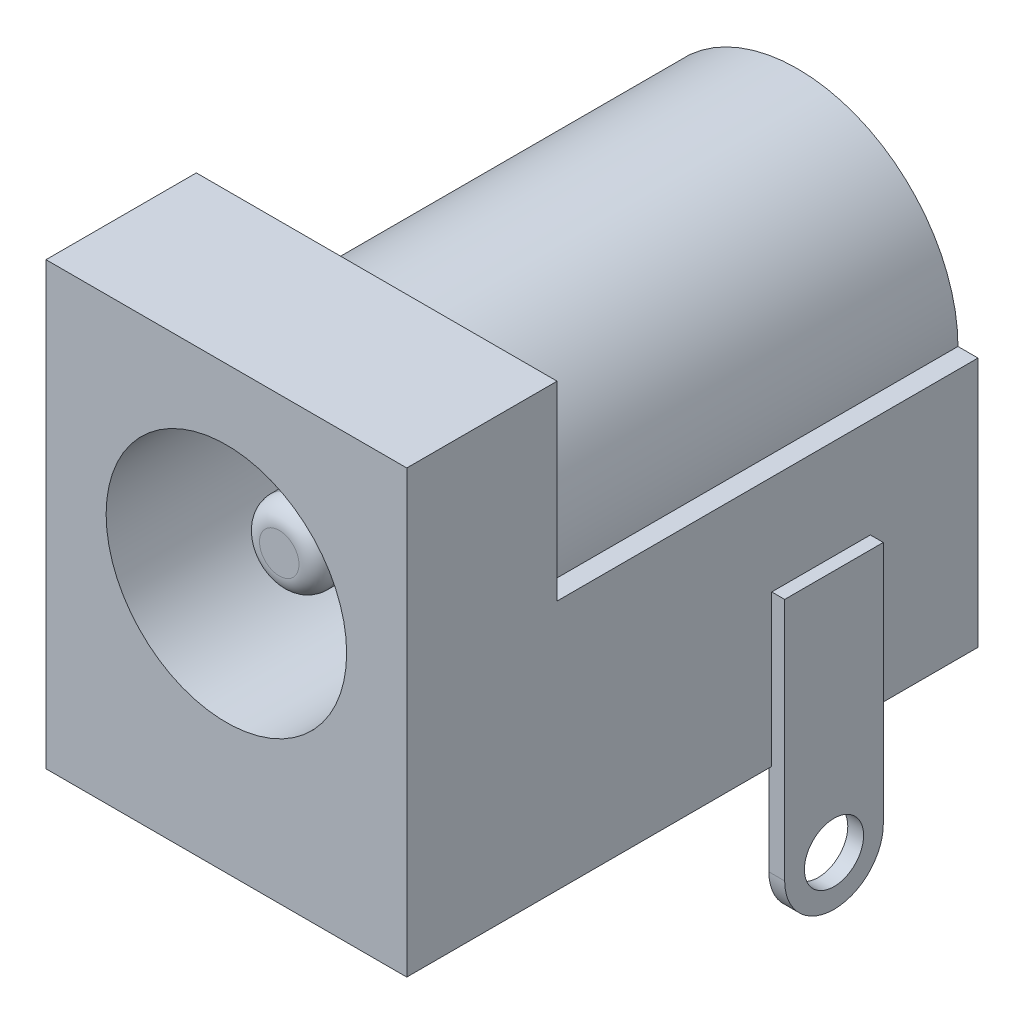
ISO-10303-21;
HEADER;
FILE_DESCRIPTION(('STEP AP214'),'2;1');
FILE_NAME('part.step','',(''),(''),'','','');
FILE_SCHEMA(('AUTOMOTIVE_DESIGN { 1 0 10303 214 1 1 1 1 }'));
ENDSEC;
DATA;
#1=APPLICATION_CONTEXT('core data for automotive mechanical design processes');
#2=APPLICATION_PROTOCOL_DEFINITION('international standard','automotive_design',2000,#1);
#3=PRODUCT_CONTEXT('',#1,'mechanical');
#4=PRODUCT('Part','Part','',(#3));
#5=PRODUCT_RELATED_PRODUCT_CATEGORY('part','',(#4));
#6=PRODUCT_DEFINITION_FORMATION('','',#4);
#7=PRODUCT_DEFINITION_CONTEXT('part definition',#1,'design');
#8=PRODUCT_DEFINITION('design','',#6,#7);
#9=PRODUCT_DEFINITION_SHAPE('','',#8);
#10=(LENGTH_UNIT() NAMED_UNIT(*) SI_UNIT(.MILLI.,.METRE.));
#11=(NAMED_UNIT(*) PLANE_ANGLE_UNIT() SI_UNIT($,.RADIAN.));
#12=(NAMED_UNIT(*) SI_UNIT($,.STERADIAN.) SOLID_ANGLE_UNIT());
#13=UNCERTAINTY_MEASURE_WITH_UNIT(LENGTH_MEASURE(1.E-05),#10,'distance_accuracy_value','');
#14=(GEOMETRIC_REPRESENTATION_CONTEXT(3) GLOBAL_UNCERTAINTY_ASSIGNED_CONTEXT((#13)) GLOBAL_UNIT_ASSIGNED_CONTEXT((#10,
#11,#12)) REPRESENTATION_CONTEXT('',''));
#15=CARTESIAN_POINT('',(0.,0.,0.));
#16=DIRECTION('',(0.,0.,1.));
#17=DIRECTION('',(1.,0.,0.));
#18=AXIS2_PLACEMENT_3D('',#15,#16,#17);
#19=CARTESIAN_POINT('',(-4.572,0.,-3.81));
#20=DIRECTION('',(0.,-1.,0.));
#21=DIRECTION('',(1.,0.,0.));
#22=AXIS2_PLACEMENT_3D('',#19,#20,#21);
#23=PLANE('',#22);
#24=DIRECTION('',(-1.,0.,0.));
#25=VECTOR('',#24,1.);
#26=CARTESIAN_POINT('',(-1.1,0.,-7.65));
#27=LINE('',#26,#25);
#28=CARTESIAN_POINT('',(1.1,0.,-7.65));
#29=VERTEX_POINT('',#28);
#30=CARTESIAN_POINT('',(-1.1,0.,-7.65));
#31=VERTEX_POINT('',#30);
#32=EDGE_CURVE('E57',#29,#31,#27,.T.);
#33=ORIENTED_EDGE('',*,*,#32,.T.);
#34=DIRECTION('',(0.,0.,-1.));
#35=VECTOR('',#34,1.);
#36=CARTESIAN_POINT('',(-1.1,0.,-7.35));
#37=LINE('',#36,#35);
#38=CARTESIAN_POINT('',(-1.1,0.,-7.35));
#39=VERTEX_POINT('',#38);
#40=EDGE_CURVE('E243',#39,#31,#37,.T.);
#41=ORIENTED_EDGE('',*,*,#40,.F.);
#42=DIRECTION('',(-1.,0.,0.));
#43=VECTOR('',#42,1.);
#44=CARTESIAN_POINT('',(-1.1,0.,-7.35));
#45=LINE('',#44,#43);
#46=CARTESIAN_POINT('',(1.1,0.,-7.35));
#47=VERTEX_POINT('',#46);
#48=EDGE_CURVE('E218',#47,#39,#45,.T.);
#49=ORIENTED_EDGE('',*,*,#48,.F.);
#50=DIRECTION('',(0.,0.,-1.));
#51=VECTOR('',#50,1.);
#52=CARTESIAN_POINT('',(1.1,0.,-7.35));
#53=LINE('',#52,#51);
#54=EDGE_CURVE('E228',#47,#29,#53,.T.);
#55=ORIENTED_EDGE('',*,*,#54,.T.);
#56=EDGE_LOOP('',(#33,#41,#49,#55));
#57=FACE_BOUND('',#56,.T.);
#58=DIRECTION('',(0.,0.,-1.));
#59=VECTOR('',#58,1.);
#60=CARTESIAN_POINT('',(4.5,0.,-3.81));
#61=LINE('',#60,#59);
#62=CARTESIAN_POINT('',(4.5,0.,-9.2499999999999));
#63=VERTEX_POINT('',#62);
#64=CARTESIAN_POINT('',(4.5,0.,-11.7499999999999));
#65=VERTEX_POINT('',#64);
#66=EDGE_CURVE('E350',#63,#65,#61,.T.);
#67=ORIENTED_EDGE('',*,*,#66,.F.);
#68=DIRECTION('',(1.,0.,0.));
#69=VECTOR('',#68,1.);
#70=CARTESIAN_POINT('',(-4.572,0.,-9.2499999999999));
#71=LINE('',#70,#69);
#72=CARTESIAN_POINT('',(4.572,0.,-9.2499999999999));
#73=VERTEX_POINT('',#72);
#74=EDGE_CURVE('E42',#63,#73,#71,.T.);
#75=ORIENTED_EDGE('',*,*,#74,.T.);
#76=DIRECTION('',(0.,0.,1.));
#77=VECTOR('',#76,1.);
#78=CARTESIAN_POINT('',(4.572,0.,-3.81));
#79=LINE('',#78,#77);
#80=CARTESIAN_POINT('',(4.572,0.,0.));
#81=VERTEX_POINT('',#80);
#82=EDGE_CURVE('E357',#73,#81,#79,.T.);
#83=ORIENTED_EDGE('',*,*,#82,.T.);
#84=DIRECTION('',(1.,0.,0.));
#85=VECTOR('',#84,1.);
#86=CARTESIAN_POINT('',(-4.572,0.,0.));
#87=LINE('',#86,#85);
#88=CARTESIAN_POINT('',(-4.572,0.,0.));
#89=VERTEX_POINT('',#88);
#90=EDGE_CURVE('E387',#89,#81,#87,.T.);
#91=ORIENTED_EDGE('',*,*,#90,.F.);
#92=DIRECTION('',(0.,0.,1.));
#93=VECTOR('',#92,1.);
#94=CARTESIAN_POINT('',(-4.572,0.,-3.81));
#95=LINE('',#94,#93);
#96=CARTESIAN_POINT('',(-4.572,0.,-14.478));
#97=VERTEX_POINT('',#96);
#98=EDGE_CURVE('E367',#97,#89,#95,.T.);
#99=ORIENTED_EDGE('',*,*,#98,.F.);
#100=DIRECTION('',(-1.,0.,0.));
#101=VECTOR('',#100,1.);
#102=CARTESIAN_POINT('',(-4.572,0.,-14.478));
#103=LINE('',#102,#101);
#104=CARTESIAN_POINT('',(4.572,0.,-14.478));
#105=VERTEX_POINT('',#104);
#106=EDGE_CURVE('E304',#105,#97,#103,.T.);
#107=ORIENTED_EDGE('',*,*,#106,.F.);
#108=CARTESIAN_POINT('',(4.572,0.,-11.7499999999999));
#109=VERTEX_POINT('',#108);
#110=EDGE_CURVE('E366',#105,#109,#79,.T.);
#111=ORIENTED_EDGE('',*,*,#110,.T.);
#112=DIRECTION('',(-1.,0.,0.));
#113=VECTOR('',#112,1.);
#114=CARTESIAN_POINT('',(-4.572,0.,-11.7499999999999));
#115=LINE('',#114,#113);
#116=EDGE_CURVE('E347',#109,#65,#115,.T.);
#117=ORIENTED_EDGE('',*,*,#116,.T.);
#118=EDGE_LOOP('',(#67,#75,#83,#91,#99,#107,#111,#117));
#119=FACE_BOUND('',#118,.T.);
#120=DIRECTION('',(-1.,0.,0.));
#121=VECTOR('',#120,1.);
#122=CARTESIAN_POINT('',(1.425,0.,-13.9));
#123=LINE('',#122,#121);
#124=CARTESIAN_POINT('',(1.425,0.,-13.9));
#125=VERTEX_POINT('',#124);
#126=CARTESIAN_POINT('',(-1.425,0.,-13.9));
#127=VERTEX_POINT('',#126);
#128=EDGE_CURVE('E49',#125,#127,#123,.T.);
#129=ORIENTED_EDGE('',*,*,#128,.T.);
#130=DIRECTION('',(0.,0.,-1.));
#131=VECTOR('',#130,1.);
#132=CARTESIAN_POINT('',(-1.425,0.,-13.5));
#133=LINE('',#132,#131);
#134=CARTESIAN_POINT('',(-1.425,0.,-13.5));
#135=VERTEX_POINT('',#134);
#136=EDGE_CURVE('E189',#135,#127,#133,.T.);
#137=ORIENTED_EDGE('',*,*,#136,.F.);
#138=DIRECTION('',(-1.,0.,0.));
#139=VECTOR('',#138,1.);
#140=CARTESIAN_POINT('',(1.425,0.,-13.5));
#141=LINE('',#140,#139);
#142=CARTESIAN_POINT('',(1.425,0.,-13.5));
#143=VERTEX_POINT('',#142);
#144=EDGE_CURVE('E195',#143,#135,#141,.T.);
#145=ORIENTED_EDGE('',*,*,#144,.F.);
#146=DIRECTION('',(0.,0.,-1.));
#147=VECTOR('',#146,1.);
#148=CARTESIAN_POINT('',(1.425,0.,-13.5));
#149=LINE('',#148,#147);
#150=EDGE_CURVE('E696',#143,#125,#149,.T.);
#151=ORIENTED_EDGE('',*,*,#150,.T.);
#152=EDGE_LOOP('',(#129,#137,#145,#151));
#153=FACE_BOUND('',#152,.T.);
#154=ADVANCED_FACE('F34',(#57,#119,#153),#23,.T.);
#155=CARTESIAN_POINT('',(4.572,0.,-3.81));
#156=DIRECTION('',(1.,0.,0.));
#157=DIRECTION('',(0.,0.,-1.));
#158=AXIS2_PLACEMENT_3D('',#155,#156,#157);
#159=PLANE('',#158);
#160=ORIENTED_EDGE('',*,*,#82,.F.);
#161=DIRECTION('',(0.,1.,0.));
#162=VECTOR('',#161,1.);
#163=CARTESIAN_POINT('',(4.572,0.,-9.2499999999999));
#164=LINE('',#163,#162);
#165=CARTESIAN_POINT('',(4.572,3.8299999999999,-9.2499999999999));
#166=VERTEX_POINT('',#165);
#167=EDGE_CURVE('E282',#73,#166,#164,.T.);
#168=ORIENTED_EDGE('',*,*,#167,.T.);
#169=DIRECTION('',(0.,0.,-1.));
#170=VECTOR('',#169,1.);
#171=CARTESIAN_POINT('',(4.572,3.8299999999999,-3.81));
#172=LINE('',#171,#170);
#173=CARTESIAN_POINT('',(4.572,3.8299999999999,-11.7499999999999));
#174=VERTEX_POINT('',#173);
#175=EDGE_CURVE('E12',#166,#174,#172,.T.);
#176=ORIENTED_EDGE('',*,*,#175,.T.);
#177=DIRECTION('',(0.,-1.,0.));
#178=VECTOR('',#177,1.);
#179=CARTESIAN_POINT('',(4.572,0.,-11.7499999999999));
#180=LINE('',#179,#178);
#181=EDGE_CURVE('E279',#174,#109,#180,.T.);
#182=ORIENTED_EDGE('',*,*,#181,.T.);
#183=ORIENTED_EDGE('',*,*,#110,.F.);
#184=DIRECTION('',(0.,-1.,0.));
#185=VECTOR('',#184,1.);
#186=CARTESIAN_POINT('',(4.572,0.,-14.478));
#187=LINE('',#186,#185);
#188=CARTESIAN_POINT('',(4.57200000000001,6.34999999999998,-14.478));
#189=VERTEX_POINT('',#188);
#190=EDGE_CURVE('E301',#189,#105,#187,.T.);
#191=ORIENTED_EDGE('',*,*,#190,.F.);
#192=DIRECTION('',(0.,0.,1.));
#193=VECTOR('',#192,1.);
#194=CARTESIAN_POINT('',(4.57200000000001,6.34999999999998,-14.478));
#195=LINE('',#194,#193);
#196=CARTESIAN_POINT('',(4.57200000000001,6.34999999999998,-3.81));
#197=VERTEX_POINT('',#196);
#198=EDGE_CURVE('E325',#189,#197,#195,.T.);
#199=ORIENTED_EDGE('',*,*,#198,.T.);
#200=DIRECTION('',(0.,1.,0.));
#201=VECTOR('',#200,1.);
#202=CARTESIAN_POINT('',(4.572,0.,-3.81));
#203=LINE('',#202,#201);
#204=CARTESIAN_POINT('',(4.572,11.176,-3.81));
#205=VERTEX_POINT('',#204);
#206=EDGE_CURVE('E322',#197,#205,#203,.T.);
#207=ORIENTED_EDGE('',*,*,#206,.T.);
#208=DIRECTION('',(0.,0.,1.));
#209=VECTOR('',#208,1.);
#210=CARTESIAN_POINT('',(4.572,11.176,-3.81));
#211=LINE('',#210,#209);
#212=CARTESIAN_POINT('',(4.572,11.176,0.));
#213=VERTEX_POINT('',#212);
#214=EDGE_CURVE('E370',#205,#213,#211,.T.);
#215=ORIENTED_EDGE('',*,*,#214,.T.);
#216=DIRECTION('',(0.,1.,0.));
#217=VECTOR('',#216,1.);
#218=CARTESIAN_POINT('',(4.572,0.,0.));
#219=LINE('',#218,#217);
#220=EDGE_CURVE('E364',#81,#213,#219,.T.);
#221=ORIENTED_EDGE('',*,*,#220,.F.);
#222=EDGE_LOOP('',(#160,#168,#176,#182,#183,#191,#199,#207,#215,#221));
#223=FACE_BOUND('',#222,.T.);
#224=ADVANCED_FACE('F362',(#223),#159,.T.);
#225=CARTESIAN_POINT('',(0.,6.35,-9.144));
#226=DIRECTION('',(0.,0.,1.));
#227=DIRECTION('',(1.,0.,0.));
#228=AXIS2_PLACEMENT_3D('',#225,#226,#227);
#229=PLANE('',#228);
#230=CARTESIAN_POINT('',(0.,6.35,-9.144));
#231=DIRECTION('',(0.,0.,1.));
#232=DIRECTION('',(1.,0.,0.));
#233=AXIS2_PLACEMENT_3D('',#230,#231,#232);
#234=CIRCLE('',#233,3.048);
#235=CARTESIAN_POINT('',(3.048,6.35,-9.144));
#236=VERTEX_POINT('',#235);
#237=EDGE_CURVE('E289',#236,#236,#234,.T.);
#238=ORIENTED_EDGE('',*,*,#237,.T.);
#239=EDGE_LOOP('',(#238));
#240=FACE_BOUND('',#239,.T.);
#241=CARTESIAN_POINT('',(0.,6.35,-9.144));
#242=DIRECTION('',(0.,0.,1.));
#243=DIRECTION('',(1.,0.,0.));
#244=AXIS2_PLACEMENT_3D('',#241,#242,#243);
#245=CIRCLE('',#244,0.999999999999999);
#246=CARTESIAN_POINT('',(0.999999999999999,6.35,-9.144));
#247=VERTEX_POINT('',#246);
#248=EDGE_CURVE('E285',#247,#247,#245,.T.);
#249=ORIENTED_EDGE('',*,*,#248,.F.);
#250=EDGE_LOOP('',(#249));
#251=FACE_BOUND('',#250,.T.);
#252=ADVANCED_FACE('F409',(#240,#251),#229,.T.);
#253=CARTESIAN_POINT('',(-4.572,0.,-3.81));
#254=DIRECTION('',(-1.,0.,0.));
#255=DIRECTION('',(0.,-1.,0.));
#256=AXIS2_PLACEMENT_3D('',#253,#254,#255);
#257=PLANE('',#256);
#258=DIRECTION('',(0.,-1.,0.));
#259=VECTOR('',#258,1.);
#260=CARTESIAN_POINT('',(-4.572,0.,0.));
#261=LINE('',#260,#259);
#262=CARTESIAN_POINT('',(-4.572,11.176,0.));
#263=VERTEX_POINT('',#262);
#264=EDGE_CURVE('E384',#263,#89,#261,.T.);
#265=ORIENTED_EDGE('',*,*,#264,.F.);
#266=DIRECTION('',(0.,0.,1.));
#267=VECTOR('',#266,1.);
#268=CARTESIAN_POINT('',(-4.572,11.176,-3.81));
#269=LINE('',#268,#267);
#270=CARTESIAN_POINT('',(-4.572,11.176,-3.81));
#271=VERTEX_POINT('',#270);
#272=EDGE_CURVE('E344',#271,#263,#269,.T.);
#273=ORIENTED_EDGE('',*,*,#272,.F.);
#274=DIRECTION('',(0.,-1.,0.));
#275=VECTOR('',#274,1.);
#276=CARTESIAN_POINT('',(-4.572,0.,-3.81));
#277=LINE('',#276,#275);
#278=CARTESIAN_POINT('',(-4.572,6.34999999999998,-3.81));
#279=VERTEX_POINT('',#278);
#280=EDGE_CURVE('E375',#271,#279,#277,.T.);
#281=ORIENTED_EDGE('',*,*,#280,.T.);
#282=DIRECTION('',(0.,0.,1.));
#283=VECTOR('',#282,1.);
#284=CARTESIAN_POINT('',(-4.57200000000001,6.34999999999997,-14.478));
#285=LINE('',#284,#283);
#286=CARTESIAN_POINT('',(-4.57200000000001,6.34999999999997,-14.478));
#287=VERTEX_POINT('',#286);
#288=EDGE_CURVE('E329',#287,#279,#285,.T.);
#289=ORIENTED_EDGE('',*,*,#288,.F.);
#290=DIRECTION('',(0.,1.,0.));
#291=VECTOR('',#290,1.);
#292=CARTESIAN_POINT('',(-4.57200000000001,6.34999999999997,-14.478));
#293=LINE('',#292,#291);
#294=EDGE_CURVE('E307',#97,#287,#293,.T.);
#295=ORIENTED_EDGE('',*,*,#294,.F.);
#296=ORIENTED_EDGE('',*,*,#98,.T.);
#297=EDGE_LOOP('',(#265,#273,#281,#289,#295,#296));
#298=FACE_BOUND('',#297,.T.);
#299=ADVANCED_FACE('F401',(#298),#257,.T.);
#300=CARTESIAN_POINT('',(-4.572,11.176,-3.81));
#301=DIRECTION('',(0.,1.,0.));
#302=DIRECTION('',(-1.,0.,0.));
#303=AXIS2_PLACEMENT_3D('',#300,#301,#302);
#304=PLANE('',#303);
#305=DIRECTION('',(-1.,0.,0.));
#306=VECTOR('',#305,1.);
#307=CARTESIAN_POINT('',(-4.572,11.176,0.));
#308=LINE('',#307,#306);
#309=EDGE_CURVE('E378',#213,#263,#308,.T.);
#310=ORIENTED_EDGE('',*,*,#309,.F.);
#311=ORIENTED_EDGE('',*,*,#214,.F.);
#312=DIRECTION('',(-1.,0.,0.));
#313=VECTOR('',#312,1.);
#314=CARTESIAN_POINT('',(-4.572,11.176,-3.81));
#315=LINE('',#314,#313);
#316=EDGE_CURVE('E371',#205,#271,#315,.T.);
#317=ORIENTED_EDGE('',*,*,#316,.T.);
#318=ORIENTED_EDGE('',*,*,#272,.T.);
#319=EDGE_LOOP('',(#310,#311,#317,#318));
#320=FACE_BOUND('',#319,.T.);
#321=ADVANCED_FACE('F398',(#320),#304,.T.);
#322=CARTESIAN_POINT('',(-4.572,11.176,-3.81));
#323=DIRECTION('',(0.,0.,-1.));
#324=DIRECTION('',(-1.,0.,0.));
#325=AXIS2_PLACEMENT_3D('',#322,#323,#324);
#326=PLANE('',#325);
#327=DIRECTION('',(1.,0.,0.));
#328=VECTOR('',#327,1.);
#329=CARTESIAN_POINT('',(-4.064,6.35,-3.81));
#330=LINE('',#329,#328);
#331=CARTESIAN_POINT('',(-4.064,6.35,-3.81));
#332=VERTEX_POINT('',#331);
#333=EDGE_CURVE('E299',#279,#332,#330,.T.);
#334=ORIENTED_EDGE('',*,*,#333,.F.);
#335=ORIENTED_EDGE('',*,*,#280,.F.);
#336=ORIENTED_EDGE('',*,*,#316,.F.);
#337=ORIENTED_EDGE('',*,*,#206,.F.);
#338=DIRECTION('',(1.,0.,0.));
#339=VECTOR('',#338,1.);
#340=CARTESIAN_POINT('',(4.064,6.35,-3.81));
#341=LINE('',#340,#339);
#342=CARTESIAN_POINT('',(4.064,6.35,-3.81));
#343=VERTEX_POINT('',#342);
#344=EDGE_CURVE('E314',#343,#197,#341,.T.);
#345=ORIENTED_EDGE('',*,*,#344,.F.);
#346=CARTESIAN_POINT('',(0.,6.35,-3.81));
#347=DIRECTION('',(0.,0.,-1.));
#348=DIRECTION('',(1.,0.,0.));
#349=AXIS2_PLACEMENT_3D('',#346,#347,#348);
#350=CIRCLE('',#349,4.064);
#351=EDGE_CURVE('E292',#332,#343,#350,.T.);
#352=ORIENTED_EDGE('',*,*,#351,.F.);
#353=EDGE_LOOP('',(#334,#335,#336,#337,#345,#352));
#354=FACE_BOUND('',#353,.T.);
#355=ADVANCED_FACE('F400',(#354),#326,.T.);
#356=CARTESIAN_POINT('',(-4.572,11.176,0.));
#357=DIRECTION('',(0.,0.,-1.));
#358=DIRECTION('',(-1.,0.,0.));
#359=AXIS2_PLACEMENT_3D('',#356,#357,#358);
#360=PLANE('',#359);
#361=CARTESIAN_POINT('',(0.,6.35,0.));
#362=DIRECTION('',(0.,0.,1.));
#363=DIRECTION('',(1.,0.,0.));
#364=AXIS2_PLACEMENT_3D('',#361,#362,#363);
#365=CIRCLE('',#364,3.048);
#366=CARTESIAN_POINT('',(3.048,6.35,0.));
#367=VERTEX_POINT('',#366);
#368=EDGE_CURVE('E288',#367,#367,#365,.T.);
#369=ORIENTED_EDGE('',*,*,#368,.F.);
#370=EDGE_LOOP('',(#369));
#371=FACE_BOUND('',#370,.T.);
#372=ORIENTED_EDGE('',*,*,#264,.T.);
#373=ORIENTED_EDGE('',*,*,#90,.T.);
#374=ORIENTED_EDGE('',*,*,#220,.T.);
#375=ORIENTED_EDGE('',*,*,#309,.T.);
#376=EDGE_LOOP('',(#372,#373,#374,#375));
#377=FACE_BOUND('',#376,.T.);
#378=ADVANCED_FACE('F397',(#371,#377),#360,.F.);
#379=CARTESIAN_POINT('',(0.,6.35,-14.478));
#380=DIRECTION('',(0.,0.,1.));
#381=DIRECTION('',(1.,0.,0.));
#382=AXIS2_PLACEMENT_3D('',#379,#380,#381);
#383=CYLINDRICAL_SURFACE('',#382,4.064);
#384=ORIENTED_EDGE('',*,*,#351,.T.);
#385=DIRECTION('',(0.,0.,1.));
#386=VECTOR('',#385,1.);
#387=CARTESIAN_POINT('',(4.064,6.35,-14.478));
#388=LINE('',#387,#386);
#389=CARTESIAN_POINT('',(4.064,6.35,-14.478));
#390=VERTEX_POINT('',#389);
#391=EDGE_CURVE('E328',#390,#343,#388,.T.);
#392=ORIENTED_EDGE('',*,*,#391,.F.);
#393=CARTESIAN_POINT('',(0.,6.35,-14.478));
#394=DIRECTION('',(0.,0.,-1.));
#395=DIRECTION('',(1.,0.,0.));
#396=AXIS2_PLACEMENT_3D('',#393,#394,#395);
#397=CIRCLE('',#396,4.064);
#398=CARTESIAN_POINT('',(-4.064,6.35,-14.478));
#399=VERTEX_POINT('',#398);
#400=EDGE_CURVE('E295',#399,#390,#397,.T.);
#401=ORIENTED_EDGE('',*,*,#400,.F.);
#402=DIRECTION('',(0.,0.,1.));
#403=VECTOR('',#402,1.);
#404=CARTESIAN_POINT('',(-4.064,6.35,-14.478));
#405=LINE('',#404,#403);
#406=EDGE_CURVE('E311',#399,#332,#405,.T.);
#407=ORIENTED_EDGE('',*,*,#406,.T.);
#408=EDGE_LOOP('',(#384,#392,#401,#407));
#409=FACE_BOUND('',#408,.T.);
#410=ADVANCED_FACE('F511',(#409),#383,.T.);
#411=CARTESIAN_POINT('',(4.064,6.35,-14.478));
#412=DIRECTION('',(0.,-1.,0.));
#413=DIRECTION('',(1.,0.,0.));
#414=AXIS2_PLACEMENT_3D('',#411,#412,#413);
#415=PLANE('',#414);
#416=ORIENTED_EDGE('',*,*,#344,.T.);
#417=ORIENTED_EDGE('',*,*,#198,.F.);
#418=DIRECTION('',(1.,0.,0.));
#419=VECTOR('',#418,1.);
#420=CARTESIAN_POINT('',(4.064,6.35,-14.478));
#421=LINE('',#420,#419);
#422=EDGE_CURVE('E298',#390,#189,#421,.T.);
#423=ORIENTED_EDGE('',*,*,#422,.F.);
#424=ORIENTED_EDGE('',*,*,#391,.T.);
#425=EDGE_LOOP('',(#416,#417,#423,#424));
#426=FACE_BOUND('',#425,.T.);
#427=ADVANCED_FACE('F507',(#426),#415,.F.);
#428=CARTESIAN_POINT('',(-4.064,6.35,-14.478));
#429=DIRECTION('',(0.,-1.,0.));
#430=DIRECTION('',(1.,0.,0.));
#431=AXIS2_PLACEMENT_3D('',#428,#429,#430);
#432=PLANE('',#431);
#433=ORIENTED_EDGE('',*,*,#333,.T.);
#434=ORIENTED_EDGE('',*,*,#406,.F.);
#435=DIRECTION('',(1.,0.,0.));
#436=VECTOR('',#435,1.);
#437=CARTESIAN_POINT('',(-4.064,6.35,-14.478));
#438=LINE('',#437,#436);
#439=EDGE_CURVE('E309',#287,#399,#438,.T.);
#440=ORIENTED_EDGE('',*,*,#439,.F.);
#441=ORIENTED_EDGE('',*,*,#288,.T.);
#442=EDGE_LOOP('',(#433,#434,#440,#441));
#443=FACE_BOUND('',#442,.T.);
#444=ADVANCED_FACE('F503',(#443),#432,.F.);
#445=CARTESIAN_POINT('',(0.,6.35,-14.478));
#446=DIRECTION('',(0.,0.,1.));
#447=DIRECTION('',(1.,0.,0.));
#448=AXIS2_PLACEMENT_3D('',#445,#446,#447);
#449=PLANE('',#448);
#450=ORIENTED_EDGE('',*,*,#400,.T.);
#451=ORIENTED_EDGE('',*,*,#422,.T.);
#452=ORIENTED_EDGE('',*,*,#190,.T.);
#453=ORIENTED_EDGE('',*,*,#106,.T.);
#454=ORIENTED_EDGE('',*,*,#294,.T.);
#455=ORIENTED_EDGE('',*,*,#439,.T.);
#456=EDGE_LOOP('',(#450,#451,#452,#453,#454,#455));
#457=FACE_BOUND('',#456,.T.);
#458=ADVANCED_FACE('F499',(#457),#449,.F.);
#459=CARTESIAN_POINT('',(0.,6.35,-9.144));
#460=DIRECTION('',(0.,0.,1.));
#461=DIRECTION('',(1.,0.,0.));
#462=AXIS2_PLACEMENT_3D('',#459,#460,#461);
#463=CYLINDRICAL_SURFACE('',#462,3.048);
#464=ORIENTED_EDGE('',*,*,#237,.F.);
#465=EDGE_LOOP('',(#464));
#466=FACE_BOUND('',#465,.T.);
#467=ORIENTED_EDGE('',*,*,#368,.T.);
#468=EDGE_LOOP('',(#467));
#469=FACE_BOUND('',#468,.T.);
#470=ADVANCED_FACE('F492',(#466,#469),#463,.F.);
#471=CARTESIAN_POINT('',(0.,6.35,2.82842712474619));
#472=DIRECTION('',(0.,0.,-1.));
#473=DIRECTION('',(-1.,0.,0.));
#474=AXIS2_PLACEMENT_3D('',#471,#472,#473);
#475=CYLINDRICAL_SURFACE('',#474,0.999999999999999);
#476=CARTESIAN_POINT('',(0.,6.35,-1.84));
#477=DIRECTION('',(0.,0.,-1.));
#478=DIRECTION('',(-1.,0.,0.));
#479=AXIS2_PLACEMENT_3D('',#476,#477,#478);
#480=CIRCLE('',#479,0.999999999999999);
#481=CARTESIAN_POINT('',(-0.999999999999999,6.35,-1.84));
#482=VERTEX_POINT('',#481);
#483=EDGE_CURVE('E340',#482,#482,#480,.T.);
#484=ORIENTED_EDGE('',*,*,#483,.T.);
#485=EDGE_LOOP('',(#484));
#486=FACE_BOUND('',#485,.T.);
#487=ORIENTED_EDGE('',*,*,#248,.T.);
#488=EDGE_LOOP('',(#487));
#489=FACE_BOUND('',#488,.T.);
#490=ADVANCED_FACE('F488',(#486,#489),#475,.T.);
#491=CARTESIAN_POINT('',(-4.572,11.176,-1.34));
#492=DIRECTION('',(0.,0.,-1.));
#493=DIRECTION('',(-1.,0.,0.));
#494=AXIS2_PLACEMENT_3D('',#491,#492,#493);
#495=PLANE('',#494);
#496=CARTESIAN_POINT('',(0.,6.35,-1.34));
#497=DIRECTION('',(0.,0.,-1.));
#498=DIRECTION('',(-1.,0.,0.));
#499=AXIS2_PLACEMENT_3D('',#496,#497,#498);
#500=CIRCLE('',#499,0.499999999999999);
#501=CARTESIAN_POINT('',(-0.499999999999999,6.35,-1.34));
#502=VERTEX_POINT('',#501);
#503=EDGE_CURVE('E343',#502,#502,#500,.F.);
#504=ORIENTED_EDGE('',*,*,#503,.T.);
#505=EDGE_LOOP('',(#504));
#506=FACE_BOUND('',#505,.T.);
#507=ADVANCED_FACE('F485',(#506),#495,.F.);
#508=CARTESIAN_POINT('',(0.,6.35,-1.84));
#509=DIRECTION('',(0.,0.,-1.));
#510=DIRECTION('',(-1.,0.,0.));
#511=AXIS2_PLACEMENT_3D('',#508,#509,#510);
#512=DEGENERATE_TOROIDAL_SURFACE('',#511,0.499999999999999,0.5,.T.);
#513=ORIENTED_EDGE('',*,*,#503,.F.);
#514=EDGE_LOOP('',(#513));
#515=FACE_BOUND('',#514,.T.);
#516=ORIENTED_EDGE('',*,*,#483,.F.);
#517=EDGE_LOOP('',(#516));
#518=FACE_BOUND('',#517,.T.);
#519=ADVANCED_FACE('F36',(#515,#518),#512,.T.);
#520=CARTESIAN_POINT('',(4.9,-2.35000000000015,-10.4999999999999));
#521=DIRECTION('',(-1.,0.,0.));
#522=DIRECTION('',(0.,0.,1.));
#523=AXIS2_PLACEMENT_3D('',#520,#521,#522);
#524=PLANE('',#523);
#525=DIRECTION('',(0.,0.,1.));
#526=VECTOR('',#525,1.);
#527=CARTESIAN_POINT('',(4.9,3.8299999999999,-9.2499999999999));
#528=LINE('',#527,#526);
#529=CARTESIAN_POINT('',(4.9,3.8299999999999,-11.7499999999999));
#530=VERTEX_POINT('',#529);
#531=CARTESIAN_POINT('',(4.9,3.8299999999999,-9.2499999999999));
#532=VERTEX_POINT('',#531);
#533=EDGE_CURVE('E253',#530,#532,#528,.T.);
#534=ORIENTED_EDGE('',*,*,#533,.T.);
#535=DIRECTION('',(0.,-1.,0.));
#536=VECTOR('',#535,1.);
#537=CARTESIAN_POINT('',(4.9,3.8299999999999,-9.2499999999999));
#538=LINE('',#537,#536);
#539=CARTESIAN_POINT('',(4.9,-2.35000000000015,-9.2499999999999));
#540=VERTEX_POINT('',#539);
#541=EDGE_CURVE('E256',#532,#540,#538,.T.);
#542=ORIENTED_EDGE('',*,*,#541,.T.);
#543=CARTESIAN_POINT('',(4.9,-2.35000000000015,-10.4999999999999));
#544=DIRECTION('',(1.,0.,0.));
#545=DIRECTION('',(0.,0.,1.));
#546=AXIS2_PLACEMENT_3D('',#543,#544,#545);
#547=CIRCLE('',#546,1.25);
#548=CARTESIAN_POINT('',(4.9,-2.35000000000015,-11.7499999999999));
#549=VERTEX_POINT('',#548);
#550=EDGE_CURVE('E259',#540,#549,#547,.T.);
#551=ORIENTED_EDGE('',*,*,#550,.T.);
#552=DIRECTION('',(0.,1.,0.));
#553=VECTOR('',#552,1.);
#554=CARTESIAN_POINT('',(4.9,3.8299999999999,-11.7499999999999));
#555=LINE('',#554,#553);
#556=EDGE_CURVE('E261',#549,#530,#555,.T.);
#557=ORIENTED_EDGE('',*,*,#556,.T.);
#558=EDGE_LOOP('',(#534,#542,#551,#557));
#559=FACE_BOUND('',#558,.T.);
#560=CARTESIAN_POINT('',(4.9,-2.35000000000015,-10.4999999999999));
#561=DIRECTION('',(1.,0.,0.));
#562=DIRECTION('',(0.,0.,-1.));
#563=AXIS2_PLACEMENT_3D('',#560,#561,#562);
#564=CIRCLE('',#563,0.75);
#565=CARTESIAN_POINT('',(4.9,-2.35000000000015,-11.2499999999999));
#566=VERTEX_POINT('',#565);
#567=EDGE_CURVE('E247',#566,#566,#564,.T.);
#568=ORIENTED_EDGE('',*,*,#567,.F.);
#569=EDGE_LOOP('',(#568));
#570=FACE_BOUND('',#569,.T.);
#571=ADVANCED_FACE('F463',(#559,#570),#524,.F.);
#572=CARTESIAN_POINT('',(4.5,-2.35000000000015,-10.4999999999999));
#573=DIRECTION('',(-1.,0.,0.));
#574=DIRECTION('',(0.,0.,1.));
#575=AXIS2_PLACEMENT_3D('',#572,#573,#574);
#576=PLANE('',#575);
#577=DIRECTION('',(0.,-1.,0.));
#578=VECTOR('',#577,1.);
#579=CARTESIAN_POINT('',(4.5,3.8299999999999,-9.2499999999999));
#580=LINE('',#579,#578);
#581=CARTESIAN_POINT('',(4.5,-2.35000000000015,-9.2499999999999));
#582=VERTEX_POINT('',#581);
#583=EDGE_CURVE('E250',#63,#582,#580,.T.);
#584=ORIENTED_EDGE('',*,*,#583,.F.);
#585=ORIENTED_EDGE('',*,*,#66,.T.);
#586=DIRECTION('',(0.,1.,0.));
#587=VECTOR('',#586,1.);
#588=CARTESIAN_POINT('',(4.5,3.8299999999999,-11.7499999999999));
#589=LINE('',#588,#587);
#590=CARTESIAN_POINT('',(4.5,-2.35000000000015,-11.7499999999999));
#591=VERTEX_POINT('',#590);
#592=EDGE_CURVE('E257',#591,#65,#589,.T.);
#593=ORIENTED_EDGE('',*,*,#592,.F.);
#594=CARTESIAN_POINT('',(4.5,-2.35000000000015,-10.4999999999999));
#595=DIRECTION('',(1.,0.,0.));
#596=DIRECTION('',(0.,0.,1.));
#597=AXIS2_PLACEMENT_3D('',#594,#595,#596);
#598=CIRCLE('',#597,1.25);
#599=EDGE_CURVE('E265',#582,#591,#598,.T.);
#600=ORIENTED_EDGE('',*,*,#599,.F.);
#601=EDGE_LOOP('',(#584,#585,#593,#600));
#602=FACE_BOUND('',#601,.T.);
#603=CARTESIAN_POINT('',(4.5,-2.35000000000015,-10.4999999999999));
#604=DIRECTION('',(1.,0.,0.));
#605=DIRECTION('',(0.,0.,-1.));
#606=AXIS2_PLACEMENT_3D('',#603,#604,#605);
#607=CIRCLE('',#606,0.75);
#608=CARTESIAN_POINT('',(4.5,-2.35000000000015,-11.2499999999999));
#609=VERTEX_POINT('',#608);
#610=EDGE_CURVE('E246',#609,#609,#607,.T.);
#611=ORIENTED_EDGE('',*,*,#610,.T.);
#612=EDGE_LOOP('',(#611));
#613=FACE_BOUND('',#612,.T.);
#614=ADVANCED_FACE('F466',(#602,#613),#576,.T.);
#615=CARTESIAN_POINT('',(4.9,3.8299999999999,-9.2499999999999));
#616=DIRECTION('',(0.,-1.,0.));
#617=DIRECTION('',(0.,0.,-1.));
#618=AXIS2_PLACEMENT_3D('',#615,#616,#617);
#619=PLANE('',#618);
#620=ORIENTED_EDGE('',*,*,#175,.F.);
#621=DIRECTION('',(-1.,0.,0.));
#622=VECTOR('',#621,1.);
#623=CARTESIAN_POINT('',(4.9,3.8299999999999,-9.2499999999999));
#624=LINE('',#623,#622);
#625=EDGE_CURVE('E276',#532,#166,#624,.T.);
#626=ORIENTED_EDGE('',*,*,#625,.F.);
#627=ORIENTED_EDGE('',*,*,#533,.F.);
#628=DIRECTION('',(-1.,0.,0.));
#629=VECTOR('',#628,1.);
#630=CARTESIAN_POINT('',(4.9,3.8299999999999,-11.7499999999999));
#631=LINE('',#630,#629);
#632=EDGE_CURVE('E263',#530,#174,#631,.T.);
#633=ORIENTED_EDGE('',*,*,#632,.T.);
#634=EDGE_LOOP('',(#620,#626,#627,#633));
#635=FACE_BOUND('',#634,.T.);
#636=ADVANCED_FACE('F470',(#635),#619,.F.);
#637=CARTESIAN_POINT('',(4.9,3.8299999999999,-9.2499999999999));
#638=DIRECTION('',(0.,0.,-1.));
#639=DIRECTION('',(0.,1.,0.));
#640=AXIS2_PLACEMENT_3D('',#637,#638,#639);
#641=PLANE('',#640);
#642=ORIENTED_EDGE('',*,*,#167,.F.);
#643=ORIENTED_EDGE('',*,*,#74,.F.);
#644=ORIENTED_EDGE('',*,*,#583,.T.);
#645=DIRECTION('',(-1.,0.,0.));
#646=VECTOR('',#645,1.);
#647=CARTESIAN_POINT('',(4.9,-2.35000000000015,-9.2499999999999));
#648=LINE('',#647,#646);
#649=EDGE_CURVE('E273',#540,#582,#648,.T.);
#650=ORIENTED_EDGE('',*,*,#649,.F.);
#651=ORIENTED_EDGE('',*,*,#541,.F.);
#652=ORIENTED_EDGE('',*,*,#625,.T.);
#653=EDGE_LOOP('',(#642,#643,#644,#650,#651,#652));
#654=FACE_BOUND('',#653,.T.);
#655=ADVANCED_FACE('F478',(#654),#641,.F.);
#656=CARTESIAN_POINT('',(4.9,-2.35000000000015,-10.4999999999999));
#657=DIRECTION('',(-1.,0.,0.));
#658=DIRECTION('',(0.,0.,1.));
#659=AXIS2_PLACEMENT_3D('',#656,#657,#658);
#660=CYLINDRICAL_SURFACE('',#659,1.25);
#661=ORIENTED_EDGE('',*,*,#599,.T.);
#662=DIRECTION('',(-1.,0.,0.));
#663=VECTOR('',#662,1.);
#664=CARTESIAN_POINT('',(4.9,-2.35000000000015,-11.7499999999999));
#665=LINE('',#664,#663);
#666=EDGE_CURVE('E270',#549,#591,#665,.T.);
#667=ORIENTED_EDGE('',*,*,#666,.F.);
#668=ORIENTED_EDGE('',*,*,#550,.F.);
#669=ORIENTED_EDGE('',*,*,#649,.T.);
#670=EDGE_LOOP('',(#661,#667,#668,#669));
#671=FACE_BOUND('',#670,.T.);
#672=ADVANCED_FACE('F474',(#671),#660,.T.);
#673=CARTESIAN_POINT('',(4.9,3.8299999999999,-11.7499999999999));
#674=DIRECTION('',(0.,0.,1.));
#675=DIRECTION('',(1.,0.,0.));
#676=AXIS2_PLACEMENT_3D('',#673,#674,#675);
#677=PLANE('',#676);
#678=ORIENTED_EDGE('',*,*,#181,.F.);
#679=ORIENTED_EDGE('',*,*,#632,.F.);
#680=ORIENTED_EDGE('',*,*,#556,.F.);
#681=ORIENTED_EDGE('',*,*,#666,.T.);
#682=ORIENTED_EDGE('',*,*,#592,.T.);
#683=ORIENTED_EDGE('',*,*,#116,.F.);
#684=EDGE_LOOP('',(#678,#679,#680,#681,#682,#683));
#685=FACE_BOUND('',#684,.T.);
#686=ADVANCED_FACE('F461',(#685),#677,.F.);
#687=CARTESIAN_POINT('',(4.9,-2.35000000000015,-10.4999999999999));
#688=DIRECTION('',(-1.,0.,0.));
#689=DIRECTION('',(0.,0.,1.));
#690=AXIS2_PLACEMENT_3D('',#687,#688,#689);
#691=CYLINDRICAL_SURFACE('',#690,0.75);
#692=ORIENTED_EDGE('',*,*,#567,.T.);
#693=EDGE_LOOP('',(#692));
#694=FACE_BOUND('',#693,.T.);
#695=ORIENTED_EDGE('',*,*,#610,.F.);
#696=EDGE_LOOP('',(#695));
#697=FACE_BOUND('',#696,.T.);
#698=ADVANCED_FACE('F439',(#694,#697),#691,.F.);
#699=CARTESIAN_POINT('',(0.,-2.5,-7.35));
#700=DIRECTION('',(0.,0.,1.));
#701=DIRECTION('',(1.,0.,0.));
#702=AXIS2_PLACEMENT_3D('',#699,#700,#701);
#703=PLANE('',#702);
#704=ORIENTED_EDGE('',*,*,#48,.T.);
#705=DIRECTION('',(0.,-1.,0.));
#706=VECTOR('',#705,1.);
#707=CARTESIAN_POINT('',(-1.1,0.,-7.35));
#708=LINE('',#707,#706);
#709=CARTESIAN_POINT('',(-1.1,-2.5,-7.35));
#710=VERTEX_POINT('',#709);
#711=EDGE_CURVE('E221',#39,#710,#708,.T.);
#712=ORIENTED_EDGE('',*,*,#711,.T.);
#713=CARTESIAN_POINT('',(0.,-2.5,-7.35));
#714=DIRECTION('',(0.,0.,1.));
#715=DIRECTION('',(1.,0.,0.));
#716=AXIS2_PLACEMENT_3D('',#713,#714,#715);
#717=CIRCLE('',#716,1.1);
#718=CARTESIAN_POINT('',(1.1,-2.5,-7.35));
#719=VERTEX_POINT('',#718);
#720=EDGE_CURVE('E224',#710,#719,#717,.T.);
#721=ORIENTED_EDGE('',*,*,#720,.T.);
#722=DIRECTION('',(0.,1.,0.));
#723=VECTOR('',#722,1.);
#724=CARTESIAN_POINT('',(1.1,0.,-7.35));
#725=LINE('',#724,#723);
#726=EDGE_CURVE('E226',#719,#47,#725,.T.);
#727=ORIENTED_EDGE('',*,*,#726,.T.);
#728=EDGE_LOOP('',(#704,#712,#721,#727));
#729=FACE_BOUND('',#728,.T.);
#730=CARTESIAN_POINT('',(0.,-2.5,-7.35));
#731=DIRECTION('',(0.,0.,1.));
#732=DIRECTION('',(1.,0.,0.));
#733=AXIS2_PLACEMENT_3D('',#730,#731,#732);
#734=CIRCLE('',#733,0.75);
#735=CARTESIAN_POINT('',(0.75,-2.5,-7.35));
#736=VERTEX_POINT('',#735);
#737=EDGE_CURVE('E210',#736,#736,#734,.T.);
#738=ORIENTED_EDGE('',*,*,#737,.F.);
#739=EDGE_LOOP('',(#738));
#740=FACE_BOUND('',#739,.T.);
#741=ADVANCED_FACE('F436',(#729,#740),#703,.T.);
#742=CARTESIAN_POINT('',(0.,-2.5,-7.65));
#743=DIRECTION('',(0.,0.,1.));
#744=DIRECTION('',(1.,0.,0.));
#745=AXIS2_PLACEMENT_3D('',#742,#743,#744);
#746=PLANE('',#745);
#747=ORIENTED_EDGE('',*,*,#32,.F.);
#748=DIRECTION('',(0.,1.,0.));
#749=VECTOR('',#748,1.);
#750=CARTESIAN_POINT('',(1.1,0.,-7.65));
#751=LINE('',#750,#749);
#752=CARTESIAN_POINT('',(1.1,-2.5,-7.65));
#753=VERTEX_POINT('',#752);
#754=EDGE_CURVE('E222',#753,#29,#751,.T.);
#755=ORIENTED_EDGE('',*,*,#754,.F.);
#756=CARTESIAN_POINT('',(0.,-2.5,-7.65));
#757=DIRECTION('',(0.,0.,1.));
#758=DIRECTION('',(1.,0.,0.));
#759=AXIS2_PLACEMENT_3D('',#756,#757,#758);
#760=CIRCLE('',#759,1.1);
#761=CARTESIAN_POINT('',(-1.1,-2.5,-7.65));
#762=VERTEX_POINT('',#761);
#763=EDGE_CURVE('E232',#762,#753,#760,.T.);
#764=ORIENTED_EDGE('',*,*,#763,.F.);
#765=DIRECTION('',(0.,-1.,0.));
#766=VECTOR('',#765,1.);
#767=CARTESIAN_POINT('',(-1.1,0.,-7.65));
#768=LINE('',#767,#766);
#769=EDGE_CURVE('E230',#31,#762,#768,.T.);
#770=ORIENTED_EDGE('',*,*,#769,.F.);
#771=EDGE_LOOP('',(#747,#755,#764,#770));
#772=FACE_BOUND('',#771,.T.);
#773=CARTESIAN_POINT('',(0.,-2.5,-7.65));
#774=DIRECTION('',(0.,0.,1.));
#775=DIRECTION('',(1.,0.,0.));
#776=AXIS2_PLACEMENT_3D('',#773,#774,#775);
#777=CIRCLE('',#776,0.75);
#778=CARTESIAN_POINT('',(0.75,-2.5,-7.65));
#779=VERTEX_POINT('',#778);
#780=EDGE_CURVE('E207',#779,#779,#777,.T.);
#781=ORIENTED_EDGE('',*,*,#780,.T.);
#782=EDGE_LOOP('',(#781));
#783=FACE_BOUND('',#782,.T.);
#784=ADVANCED_FACE('F427',(#772,#783),#746,.F.);
#785=CARTESIAN_POINT('',(-1.1,0.,-7.35));
#786=DIRECTION('',(1.,0.,0.));
#787=DIRECTION('',(0.,1.,0.));
#788=AXIS2_PLACEMENT_3D('',#785,#786,#787);
#789=PLANE('',#788);
#790=ORIENTED_EDGE('',*,*,#769,.T.);
#791=DIRECTION('',(0.,0.,-1.));
#792=VECTOR('',#791,1.);
#793=CARTESIAN_POINT('',(-1.1,-2.5,-7.35));
#794=LINE('',#793,#792);
#795=EDGE_CURVE('E240',#710,#762,#794,.T.);
#796=ORIENTED_EDGE('',*,*,#795,.F.);
#797=ORIENTED_EDGE('',*,*,#711,.F.);
#798=ORIENTED_EDGE('',*,*,#40,.T.);
#799=EDGE_LOOP('',(#790,#796,#797,#798));
#800=FACE_BOUND('',#799,.T.);
#801=ADVANCED_FACE('F434',(#800),#789,.F.);
#802=CARTESIAN_POINT('',(0.,-2.5,-7.35));
#803=DIRECTION('',(0.,0.,-1.));
#804=DIRECTION('',(-1.,0.,0.));
#805=AXIS2_PLACEMENT_3D('',#802,#803,#804);
#806=CYLINDRICAL_SURFACE('',#805,1.1);
#807=ORIENTED_EDGE('',*,*,#763,.T.);
#808=DIRECTION('',(0.,0.,-1.));
#809=VECTOR('',#808,1.);
#810=CARTESIAN_POINT('',(1.1,-2.5,-7.35));
#811=LINE('',#810,#809);
#812=EDGE_CURVE('E237',#719,#753,#811,.T.);
#813=ORIENTED_EDGE('',*,*,#812,.F.);
#814=ORIENTED_EDGE('',*,*,#720,.F.);
#815=ORIENTED_EDGE('',*,*,#795,.T.);
#816=EDGE_LOOP('',(#807,#813,#814,#815));
#817=FACE_BOUND('',#816,.T.);
#818=ADVANCED_FACE('F430',(#817),#806,.T.);
#819=CARTESIAN_POINT('',(1.1,0.,-7.35));
#820=DIRECTION('',(-1.,0.,0.));
#821=DIRECTION('',(0.,-1.,0.));
#822=AXIS2_PLACEMENT_3D('',#819,#820,#821);
#823=PLANE('',#822);
#824=ORIENTED_EDGE('',*,*,#754,.T.);
#825=ORIENTED_EDGE('',*,*,#54,.F.);
#826=ORIENTED_EDGE('',*,*,#726,.F.);
#827=ORIENTED_EDGE('',*,*,#812,.T.);
#828=EDGE_LOOP('',(#824,#825,#826,#827));
#829=FACE_BOUND('',#828,.T.);
#830=ADVANCED_FACE('F424',(#829),#823,.F.);
#831=CARTESIAN_POINT('',(0.,-2.5,-7.35));
#832=DIRECTION('',(0.,0.,-1.));
#833=DIRECTION('',(-1.,0.,0.));
#834=AXIS2_PLACEMENT_3D('',#831,#832,#833);
#835=CYLINDRICAL_SURFACE('',#834,0.75);
#836=ORIENTED_EDGE('',*,*,#737,.T.);
#837=EDGE_LOOP('',(#836));
#838=FACE_BOUND('',#837,.T.);
#839=ORIENTED_EDGE('',*,*,#780,.F.);
#840=EDGE_LOOP('',(#839));
#841=FACE_BOUND('',#840,.T.);
#842=ADVANCED_FACE('F443',(#838,#841),#835,.F.);
#843=CARTESIAN_POINT('',(0.,-2.175,-13.5));
#844=DIRECTION('',(0.,0.,-1.));
#845=DIRECTION('',(-1.,0.,0.));
#846=AXIS2_PLACEMENT_3D('',#843,#844,#845);
#847=PLANE('',#846);
#848=ORIENTED_EDGE('',*,*,#144,.T.);
#849=DIRECTION('',(0.,-1.,0.));
#850=VECTOR('',#849,1.);
#851=CARTESIAN_POINT('',(-1.425,0.,-13.5));
#852=LINE('',#851,#850);
#853=CARTESIAN_POINT('',(-1.425,-2.175,-13.5));
#854=VERTEX_POINT('',#853);
#855=EDGE_CURVE('E185',#135,#854,#852,.T.);
#856=ORIENTED_EDGE('',*,*,#855,.T.);
#857=CARTESIAN_POINT('',(0.,-2.175,-13.5));
#858=DIRECTION('',(0.,0.,1.));
#859=DIRECTION('',(-1.,0.,0.));
#860=AXIS2_PLACEMENT_3D('',#857,#858,#859);
#861=CIRCLE('',#860,1.425);
#862=CARTESIAN_POINT('',(1.425,-2.175,-13.5));
#863=VERTEX_POINT('',#862);
#864=EDGE_CURVE('E194',#854,#863,#861,.T.);
#865=ORIENTED_EDGE('',*,*,#864,.T.);
#866=DIRECTION('',(0.,1.,0.));
#867=VECTOR('',#866,1.);
#868=CARTESIAN_POINT('',(1.425,0.,-13.5));
#869=LINE('',#868,#867);
#870=EDGE_CURVE('E201',#863,#143,#869,.T.);
#871=ORIENTED_EDGE('',*,*,#870,.T.);
#872=EDGE_LOOP('',(#848,#856,#865,#871));
#873=FACE_BOUND('',#872,.T.);
#874=CARTESIAN_POINT('',(0.,-2.175,-13.5));
#875=DIRECTION('',(0.,0.,1.));
#876=DIRECTION('',(1.,0.,0.));
#877=AXIS2_PLACEMENT_3D('',#874,#875,#876);
#878=CIRCLE('',#877,0.749999999999955);
#879=CARTESIAN_POINT('',(0.749999999999955,-2.175,-13.5));
#880=VERTEX_POINT('',#879);
#881=EDGE_CURVE('E686',#880,#880,#878,.T.);
#882=ORIENTED_EDGE('',*,*,#881,.F.);
#883=EDGE_LOOP('',(#882));
#884=FACE_BOUND('',#883,.T.);
#885=ADVANCED_FACE('F198',(#873,#884),#847,.F.);
#886=CARTESIAN_POINT('',(0.,-2.175,-13.9));
#887=DIRECTION('',(0.,0.,-1.));
#888=DIRECTION('',(-1.,0.,0.));
#889=AXIS2_PLACEMENT_3D('',#886,#887,#888);
#890=PLANE('',#889);
#891=ORIENTED_EDGE('',*,*,#128,.F.);
#892=DIRECTION('',(0.,1.,0.));
#893=VECTOR('',#892,1.);
#894=CARTESIAN_POINT('',(1.425,0.,-13.9));
#895=LINE('',#894,#893);
#896=CARTESIAN_POINT('',(1.425,-2.175,-13.9));
#897=VERTEX_POINT('',#896);
#898=EDGE_CURVE('E205',#897,#125,#895,.T.);
#899=ORIENTED_EDGE('',*,*,#898,.F.);
#900=CARTESIAN_POINT('',(0.,-2.175,-13.9));
#901=DIRECTION('',(0.,0.,1.));
#902=DIRECTION('',(-1.,0.,0.));
#903=AXIS2_PLACEMENT_3D('',#900,#901,#902);
#904=CIRCLE('',#903,1.425);
#905=CARTESIAN_POINT('',(-1.425,-2.175,-13.9));
#906=VERTEX_POINT('',#905);
#907=EDGE_CURVE('E700',#906,#897,#904,.T.);
#908=ORIENTED_EDGE('',*,*,#907,.F.);
#909=DIRECTION('',(0.,-1.,0.));
#910=VECTOR('',#909,1.);
#911=CARTESIAN_POINT('',(-1.425,0.,-13.9));
#912=LINE('',#911,#910);
#913=EDGE_CURVE('E698',#127,#906,#912,.T.);
#914=ORIENTED_EDGE('',*,*,#913,.F.);
#915=EDGE_LOOP('',(#891,#899,#908,#914));
#916=FACE_BOUND('',#915,.T.);
#917=CARTESIAN_POINT('',(0.,-2.175,-13.9));
#918=DIRECTION('',(0.,0.,1.));
#919=DIRECTION('',(1.,0.,0.));
#920=AXIS2_PLACEMENT_3D('',#917,#918,#919);
#921=CIRCLE('',#920,0.749999999999955);
#922=CARTESIAN_POINT('',(0.749999999999955,-2.175,-13.9));
#923=VERTEX_POINT('',#922);
#924=EDGE_CURVE('E689',#923,#923,#921,.T.);
#925=ORIENTED_EDGE('',*,*,#924,.T.);
#926=EDGE_LOOP('',(#925));
#927=FACE_BOUND('',#926,.T.);
#928=ADVANCED_FACE('F633',(#916,#927),#890,.T.);
#929=CARTESIAN_POINT('',(-1.425,0.,-13.5));
#930=DIRECTION('',(1.,0.,0.));
#931=DIRECTION('',(0.,1.,0.));
#932=AXIS2_PLACEMENT_3D('',#929,#930,#931);
#933=PLANE('',#932);
#934=ORIENTED_EDGE('',*,*,#913,.T.);
#935=DIRECTION('',(0.,0.,-1.));
#936=VECTOR('',#935,1.);
#937=CARTESIAN_POINT('',(-1.425,-2.175,-13.5));
#938=LINE('',#937,#936);
#939=EDGE_CURVE('E191',#854,#906,#938,.T.);
#940=ORIENTED_EDGE('',*,*,#939,.F.);
#941=ORIENTED_EDGE('',*,*,#855,.F.);
#942=ORIENTED_EDGE('',*,*,#136,.T.);
#943=EDGE_LOOP('',(#934,#940,#941,#942));
#944=FACE_BOUND('',#943,.T.);
#945=ADVANCED_FACE('F187',(#944),#933,.F.);
#946=CARTESIAN_POINT('',(0.,-2.175,-13.5));
#947=DIRECTION('',(0.,0.,-1.));
#948=DIRECTION('',(-1.,0.,0.));
#949=AXIS2_PLACEMENT_3D('',#946,#947,#948);
#950=CYLINDRICAL_SURFACE('',#949,1.425);
#951=ORIENTED_EDGE('',*,*,#907,.T.);
#952=DIRECTION('',(0.,0.,-1.));
#953=VECTOR('',#952,1.);
#954=CARTESIAN_POINT('',(1.425,-2.175,-13.5));
#955=LINE('',#954,#953);
#956=EDGE_CURVE('E212',#863,#897,#955,.T.);
#957=ORIENTED_EDGE('',*,*,#956,.F.);
#958=ORIENTED_EDGE('',*,*,#864,.F.);
#959=ORIENTED_EDGE('',*,*,#939,.T.);
#960=EDGE_LOOP('',(#951,#957,#958,#959));
#961=FACE_BOUND('',#960,.T.);
#962=ADVANCED_FACE('F650',(#961),#950,.T.);
#963=CARTESIAN_POINT('',(1.425,0.,-13.5));
#964=DIRECTION('',(-1.,0.,0.));
#965=DIRECTION('',(0.,0.,1.));
#966=AXIS2_PLACEMENT_3D('',#963,#964,#965);
#967=PLANE('',#966);
#968=ORIENTED_EDGE('',*,*,#898,.T.);
#969=ORIENTED_EDGE('',*,*,#150,.F.);
#970=ORIENTED_EDGE('',*,*,#870,.F.);
#971=ORIENTED_EDGE('',*,*,#956,.T.);
#972=EDGE_LOOP('',(#968,#969,#970,#971));
#973=FACE_BOUND('',#972,.T.);
#974=ADVANCED_FACE('F659',(#973),#967,.F.);
#975=CARTESIAN_POINT('',(0.,-2.175,-13.5));
#976=DIRECTION('',(0.,0.,-1.));
#977=DIRECTION('',(-1.,0.,0.));
#978=AXIS2_PLACEMENT_3D('',#975,#976,#977);
#979=CYLINDRICAL_SURFACE('',#978,0.749999999999955);
#980=ORIENTED_EDGE('',*,*,#881,.T.);
#981=EDGE_LOOP('',(#980));
#982=FACE_BOUND('',#981,.T.);
#983=ORIENTED_EDGE('',*,*,#924,.F.);
#984=EDGE_LOOP('',(#983));
#985=FACE_BOUND('',#984,.T.);
#986=ADVANCED_FACE('F669',(#982,#985),#979,.F.);
#987=CLOSED_SHELL('',(#154,#224,#252,#299,#321,#355,#378,#410,#427,#444,#458,#470,#490,#507,
#519,#571,#614,#636,#655,#672,#686,#698,#741,#784,#801,#818,#830,#842,#885,#928,#945,#962,#974,#986));
#988=MANIFOLD_SOLID_BREP('B2',#987);
#989=ADVANCED_BREP_SHAPE_REPRESENTATION('',(#18,#988),#14);
#990=SHAPE_DEFINITION_REPRESENTATION(#9,#989);
ENDSEC;
END-ISO-10303-21;
